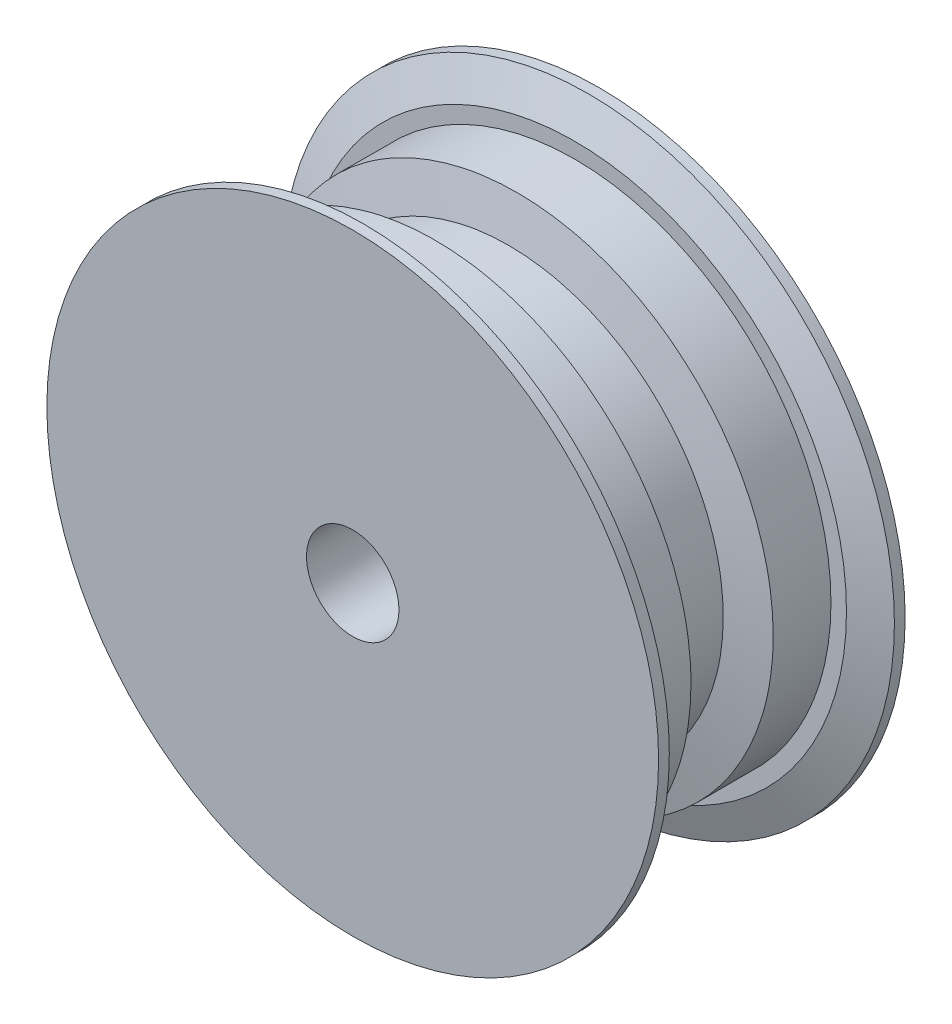
ISO-10303-21;
HEADER;
FILE_DESCRIPTION(('STEP AP214'),'2;1');
FILE_NAME('part.step','',(''),(''),'','','');
FILE_SCHEMA(('AUTOMOTIVE_DESIGN { 1 0 10303 214 1 1 1 1 }'));
ENDSEC;
DATA;
#1=APPLICATION_CONTEXT('core data for automotive mechanical design processes');
#2=APPLICATION_PROTOCOL_DEFINITION('international standard','automotive_design',2000,#1);
#3=PRODUCT_CONTEXT('',#1,'mechanical');
#4=PRODUCT('Part','Part','',(#3));
#5=PRODUCT_RELATED_PRODUCT_CATEGORY('part','',(#4));
#6=PRODUCT_DEFINITION_FORMATION('','',#4);
#7=PRODUCT_DEFINITION_CONTEXT('part definition',#1,'design');
#8=PRODUCT_DEFINITION('design','',#6,#7);
#9=PRODUCT_DEFINITION_SHAPE('','',#8);
#10=(LENGTH_UNIT() NAMED_UNIT(*) SI_UNIT(.MILLI.,.METRE.));
#11=(NAMED_UNIT(*) PLANE_ANGLE_UNIT() SI_UNIT($,.RADIAN.));
#12=(NAMED_UNIT(*) SI_UNIT($,.STERADIAN.) SOLID_ANGLE_UNIT());
#13=UNCERTAINTY_MEASURE_WITH_UNIT(LENGTH_MEASURE(1.E-05),#10,'distance_accuracy_value','');
#14=(GEOMETRIC_REPRESENTATION_CONTEXT(3) GLOBAL_UNCERTAINTY_ASSIGNED_CONTEXT((#13)) GLOBAL_UNIT_ASSIGNED_CONTEXT((#10,
#11,#12)) REPRESENTATION_CONTEXT('',''));
#15=CARTESIAN_POINT('',(0.,0.,0.));
#16=DIRECTION('',(0.,0.,1.));
#17=DIRECTION('',(1.,0.,0.));
#18=AXIS2_PLACEMENT_3D('',#15,#16,#17);
#19=CARTESIAN_POINT('',(-15.92453,0.,-2.415330196));
#20=CARTESIAN_POINT('',(-15.92453,-2.08451610153185,-2.415330196));
#21=CARTESIAN_POINT('',(-15.5100571084165,-4.1682120378053,-2.415330196));
#22=CARTESIAN_POINT('',(-13.9146375553075,-8.01989556059634,-2.415330196));
#23=CARTESIAN_POINT('',(-12.7343186210947,-9.78636767932256,-2.415330196));
#24=CARTESIAN_POINT('',(-9.78636767932254,-12.7343186210947,-2.415330196));
#25=CARTESIAN_POINT('',(-8.01989556059562,-13.9146375553078,-2.415330196));
#26=CARTESIAN_POINT('',(-4.16821203780611,-15.5100571084162,-2.415330196));
#27=CARTESIAN_POINT('',(-2.08451610153184,-15.92453,-2.415330196));
#28=CARTESIAN_POINT('',(2.08451610153186,-15.92453,-2.415330196));
#29=CARTESIAN_POINT('',(4.16821203782218,-15.5100571084095,-2.415330196));
#30=CARTESIAN_POINT('',(8.01989556057951,-13.9146375553144,-2.415330196));
#31=CARTESIAN_POINT('',(9.78636767932256,-12.7343186210947,-2.415330196));
#32=CARTESIAN_POINT('',(12.7343186210947,-9.78636767932254,-2.415330196));
#33=CARTESIAN_POINT('',(13.9146375553072,-8.01989556059687,-2.415330196));
#34=CARTESIAN_POINT('',(15.5100571084167,-4.16821203780481,-2.415330196));
#35=CARTESIAN_POINT('',(15.92453,-2.08451610152868,-2.415330196));
#36=CARTESIAN_POINT('',(15.92453,2.08451610152868,-2.415330196));
#37=CARTESIAN_POINT('',(15.5100571084166,4.16821203780513,-2.415330196));
#38=CARTESIAN_POINT('',(13.9146375553074,8.01989556059655,-2.415330196));
#39=CARTESIAN_POINT('',(12.7343186210947,9.78636767932255,-2.415330196));
#40=CARTESIAN_POINT('',(9.78636767932255,12.7343186210947,-2.415330196));
#41=CARTESIAN_POINT('',(8.0198955605982,13.9146375553067,-2.415330196));
#42=CARTESIAN_POINT('',(4.16821203780347,15.5100571084172,-2.415330196));
#43=CARTESIAN_POINT('',(2.08451610153185,15.92453,-2.415330196));
#44=CARTESIAN_POINT('',(-2.08451610153185,15.92453,-2.415330196));
#45=CARTESIAN_POINT('',(-4.16821203780593,15.5100571084162,-2.415330196));
#46=CARTESIAN_POINT('',(-8.01989556059577,13.9146375553077,-2.415330196));
#47=CARTESIAN_POINT('',(-9.78636767932256,12.7343186210947,-2.415330196));
#48=CARTESIAN_POINT('',(-12.7343186210947,9.78636767932254,-2.415330196));
#49=CARTESIAN_POINT('',(-13.9146375553071,8.0198955605973,-2.415330196));
#50=CARTESIAN_POINT('',(-15.5100571084169,4.16821203780442,-2.415330196));
#51=CARTESIAN_POINT('',(-15.92453,2.08451610153185,-2.415330196));
#52=CARTESIAN_POINT('',(-15.92453,0.,-2.415330196));
#53=CARTESIAN_POINT('',(-18.996410064,0.,-3.050330196));
#54=CARTESIAN_POINT('',(-18.996410064,-2.48662426141994,-3.050330196));
#55=CARTESIAN_POINT('',(-18.5019843566856,-4.97227014573484,-3.050330196));
#56=CARTESIAN_POINT('',(-16.5988045419565,-9.56695266607761,-3.050330196));
#57=CARTESIAN_POINT('',(-15.190799251967,-11.6741814969426,-3.050330196));
#58=CARTESIAN_POINT('',(-11.6741814969426,-15.190799251967,-3.050330196));
#59=CARTESIAN_POINT('',(-9.56695266607767,-16.5988045419564,-3.050330196));
#60=CARTESIAN_POINT('',(-4.97227014573489,-18.5019843566856,-3.050330196));
#61=CARTESIAN_POINT('',(-2.48662426141993,-18.996410064,-3.050330196));
#62=CARTESIAN_POINT('',(2.48662426141995,-18.996410064,-3.050330196));
#63=CARTESIAN_POINT('',(4.97227014575428,-18.501984356677,-3.050330196));
#64=CARTESIAN_POINT('',(9.56695266605823,-16.5988045419651,-3.050330196));
#65=CARTESIAN_POINT('',(11.6741814969426,-15.190799251967,-3.050330196));
#66=CARTESIAN_POINT('',(15.190799251967,-11.6741814969426,-3.050330196));
#67=CARTESIAN_POINT('',(16.5988045419598,-9.56695266608006,-3.050330196));
#68=CARTESIAN_POINT('',(18.5019843566823,-4.97227014573244,-3.050330196));
#69=CARTESIAN_POINT('',(18.996410064,-2.48662426141617,-3.050330196));
#70=CARTESIAN_POINT('',(18.996410064,2.48662426141617,-3.050330196));
#71=CARTESIAN_POINT('',(18.5019843566866,4.97227014573568,-3.050330196));
#72=CARTESIAN_POINT('',(16.5988045419554,9.56695266607683,-3.050330196));
#73=CARTESIAN_POINT('',(15.1907992519691,11.6741814969426,-3.050330196));
#74=CARTESIAN_POINT('',(11.6741814969404,15.190799251967,-3.050330196));
#75=CARTESIAN_POINT('',(9.56695266607871,16.5988045419564,-3.050330196));
#76=CARTESIAN_POINT('',(4.97227014573378,18.5019843566856,-3.050330196));
#77=CARTESIAN_POINT('',(2.48662426141994,18.996410064,-3.050330196));
#78=CARTESIAN_POINT('',(-2.48662426141994,18.996410064,-3.050330196));
#79=CARTESIAN_POINT('',(-4.9722701457338,18.5019843566813,-3.050330196));
#80=CARTESIAN_POINT('',(-9.56695266607872,16.5988045419607,-3.050330196));
#81=CARTESIAN_POINT('',(-11.6741814969426,15.190799251967,-3.050330196));
#82=CARTESIAN_POINT('',(-15.190799251967,11.6741814969426,-3.050330196));
#83=CARTESIAN_POINT('',(-16.5988045419564,9.56695266607766,-3.050330196));
#84=CARTESIAN_POINT('',(-18.5019843566856,4.97227014573489,-3.050330196));
#85=CARTESIAN_POINT('',(-18.996410064,2.48662426141994,-3.050330196));
#86=CARTESIAN_POINT('',(-18.996410064,0.,-3.050330196));
#87=B_SPLINE_SURFACE_WITH_KNOTS('',1,3,((#19,#20,#21,#22,#23,#24,#25,#26,#27,#28,#29,#30,#31,
#32,#33,#34,#35,#36,#37,#38,#39,#40,#41,#42,#43,#44,#45,#46,#47,#48,#49,#50,#51,#52),(#53,#54,
#55,#56,#57,#58,#59,#60,#61,#62,#63,#64,#65,#66,#67,#68,#69,#70,#71,#72,#73,#74,#75,#76,#77,#78,
#79,#80,#81,#82,#83,#84,#85,#86)),.UNSPECIFIED.,.F.,.T.,.F.,(2,2),(4,2,2,2,2,2,2,2,2,2,2,2,2,2,
2,2,4),(0.,1.),(-3.14159265358979,-2.74889357189107,-2.35619449019234,-1.96349540849362,
-1.5707963267949,-1.17809724509617,-0.785398163397448,-0.392699081698724,0.,0.392699081698724,
0.785398163397448,1.17809724509617,1.5707963267949,1.96349540849362,2.35619449019234,
2.74889357189107,3.14159265358979),.UNSPECIFIED.);
#88=CARTESIAN_POINT('',(-18.996410064,0.,-3.050330196));
#89=CARTESIAN_POINT('',(-18.996410064,-2.48662426141994,-3.050330196));
#90=CARTESIAN_POINT('',(-18.5019843566856,-4.97227014573484,-3.050330196));
#91=CARTESIAN_POINT('',(-16.5988045419565,-9.56695266607761,-3.050330196));
#92=CARTESIAN_POINT('',(-15.190799251967,-11.6741814969426,-3.050330196));
#93=CARTESIAN_POINT('',(-11.6741814969426,-15.190799251967,-3.050330196));
#94=CARTESIAN_POINT('',(-9.56695266607767,-16.5988045419564,-3.050330196));
#95=CARTESIAN_POINT('',(-4.97227014573489,-18.5019843566856,-3.050330196));
#96=CARTESIAN_POINT('',(-2.48662426141993,-18.996410064,-3.050330196));
#97=CARTESIAN_POINT('',(2.48662426141995,-18.996410064,-3.050330196));
#98=CARTESIAN_POINT('',(4.97227014575428,-18.501984356677,-3.050330196));
#99=CARTESIAN_POINT('',(9.56695266605823,-16.5988045419651,-3.050330196));
#100=CARTESIAN_POINT('',(11.6741814969426,-15.190799251967,-3.050330196));
#101=CARTESIAN_POINT('',(15.190799251967,-11.6741814969426,-3.050330196));
#102=CARTESIAN_POINT('',(16.5988045419598,-9.56695266608006,-3.050330196));
#103=CARTESIAN_POINT('',(18.5019843566823,-4.97227014573244,-3.050330196));
#104=CARTESIAN_POINT('',(18.996410064,-2.48662426141617,-3.050330196));
#105=CARTESIAN_POINT('',(18.996410064,2.48662426141617,-3.050330196));
#106=CARTESIAN_POINT('',(18.5019843566866,4.97227014573568,-3.050330196));
#107=CARTESIAN_POINT('',(16.5988045419554,9.56695266607683,-3.050330196));
#108=CARTESIAN_POINT('',(15.1907992519691,11.6741814969426,-3.050330196));
#109=CARTESIAN_POINT('',(11.6741814969404,15.190799251967,-3.050330196));
#110=CARTESIAN_POINT('',(9.56695266607871,16.5988045419564,-3.050330196));
#111=CARTESIAN_POINT('',(4.97227014573378,18.5019843566856,-3.050330196));
#112=CARTESIAN_POINT('',(2.48662426141994,18.996410064,-3.050330196));
#113=CARTESIAN_POINT('',(-2.48662426141994,18.996410064,-3.050330196));
#114=CARTESIAN_POINT('',(-4.9722701457338,18.5019843566813,-3.050330196));
#115=CARTESIAN_POINT('',(-9.56695266607872,16.5988045419607,-3.050330196));
#116=CARTESIAN_POINT('',(-11.6741814969426,15.190799251967,-3.050330196));
#117=CARTESIAN_POINT('',(-15.190799251967,11.6741814969426,-3.050330196));
#118=CARTESIAN_POINT('',(-16.5988045419564,9.56695266607766,-3.050330196));
#119=CARTESIAN_POINT('',(-18.5019843566856,4.97227014573489,-3.050330196));
#120=CARTESIAN_POINT('',(-18.996410064,2.48662426141994,-3.050330196));
#121=CARTESIAN_POINT('',(-18.996410064,0.,-3.050330196));
#122=B_SPLINE_CURVE_WITH_KNOTS('',3,(#88,#89,#90,#91,#92,#93,#94,#95,#96,#97,#98,#99,#100,#101,
#102,#103,#104,#105,#106,#107,#108,#109,#110,#111,#112,#113,#114,#115,#116,#117,#118,#119,#120,
#121),.UNSPECIFIED.,.T.,.F.,(4,2,2,2,2,2,2,2,2,2,2,2,2,2,2,2,4),(-3.14159265358979,
-2.74889357189107,-2.35619449019234,-1.96349540849362,-1.5707963267949,-1.17809724509617,
-0.785398163397448,-0.392699081698724,0.,0.392699081698724,0.785398163397448,1.17809724509617,
1.5707963267949,1.96349540849362,2.35619449019234,2.74889357189107,3.14159265358979),.UNSPECIFIED.);
#123=CARTESIAN_POINT('',(-18.996410064,0.,-3.050330196));
#124=VERTEX_POINT('',#123);
#125=EDGE_CURVE('E216',#124,#124,#122,.F.);
#126=CARTESIAN_POINT('',(-15.92453,0.,-2.415330196));
#127=CARTESIAN_POINT('',(-15.92453,2.08451610153185,-2.415330196));
#128=CARTESIAN_POINT('',(-15.5100571084169,4.16821203780442,-2.415330196));
#129=CARTESIAN_POINT('',(-13.9146375553071,8.0198955605973,-2.415330196));
#130=CARTESIAN_POINT('',(-12.7343186210947,9.78636767932254,-2.415330196));
#131=CARTESIAN_POINT('',(-9.78636767932256,12.7343186210947,-2.415330196));
#132=CARTESIAN_POINT('',(-8.01989556059577,13.9146375553077,-2.415330196));
#133=CARTESIAN_POINT('',(-4.16821203780593,15.5100571084162,-2.415330196));
#134=CARTESIAN_POINT('',(-2.08451610153185,15.92453,-2.415330196));
#135=CARTESIAN_POINT('',(2.08451610153185,15.92453,-2.415330196));
#136=CARTESIAN_POINT('',(4.16821203780347,15.5100571084172,-2.415330196));
#137=CARTESIAN_POINT('',(8.0198955605982,13.9146375553067,-2.415330196));
#138=CARTESIAN_POINT('',(9.78636767932255,12.7343186210947,-2.415330196));
#139=CARTESIAN_POINT('',(12.7343186210947,9.78636767932255,-2.415330196));
#140=CARTESIAN_POINT('',(13.9146375553074,8.01989556059655,-2.415330196));
#141=CARTESIAN_POINT('',(15.5100571084166,4.16821203780513,-2.415330196));
#142=CARTESIAN_POINT('',(15.92453,2.08451610152868,-2.415330196));
#143=CARTESIAN_POINT('',(15.92453,-2.08451610152868,-2.415330196));
#144=CARTESIAN_POINT('',(15.5100571084167,-4.16821203780481,-2.415330196));
#145=CARTESIAN_POINT('',(13.9146375553072,-8.01989556059687,-2.415330196));
#146=CARTESIAN_POINT('',(12.7343186210947,-9.78636767932254,-2.415330196));
#147=CARTESIAN_POINT('',(9.78636767932256,-12.7343186210947,-2.415330196));
#148=CARTESIAN_POINT('',(8.01989556057951,-13.9146375553144,-2.415330196));
#149=CARTESIAN_POINT('',(4.16821203782218,-15.5100571084095,-2.415330196));
#150=CARTESIAN_POINT('',(2.08451610153186,-15.92453,-2.415330196));
#151=CARTESIAN_POINT('',(-2.08451610153184,-15.92453,-2.415330196));
#152=CARTESIAN_POINT('',(-4.16821203780611,-15.5100571084162,-2.415330196));
#153=CARTESIAN_POINT('',(-8.01989556059562,-13.9146375553078,-2.415330196));
#154=CARTESIAN_POINT('',(-9.78636767932254,-12.7343186210947,-2.415330196));
#155=CARTESIAN_POINT('',(-12.7343186210947,-9.78636767932256,-2.415330196));
#156=CARTESIAN_POINT('',(-13.9146375553075,-8.01989556059634,-2.415330196));
#157=CARTESIAN_POINT('',(-15.5100571084165,-4.1682120378053,-2.415330196));
#158=CARTESIAN_POINT('',(-15.92453,-2.08451610153185,-2.415330196));
#159=CARTESIAN_POINT('',(-15.92453,0.,-2.415330196));
#160=B_SPLINE_CURVE_WITH_KNOTS('',3,(#126,#127,#128,#129,#130,#131,#132,#133,#134,#135,#136,
#137,#138,#139,#140,#141,#142,#143,#144,#145,#146,#147,#148,#149,#150,#151,#152,#153,#154,#155,
#156,#157,#158,#159),.UNSPECIFIED.,.T.,.F.,(4,2,2,2,2,2,2,2,2,2,2,2,2,2,2,2,4),
(-3.14159265358979,-2.74889357189107,-2.35619449019234,-1.96349540849362,-1.5707963267949,
-1.17809724509617,-0.785398163397448,-0.392699081698724,0.,0.392699081698724,0.785398163397448,
1.17809724509617,1.5707963267949,1.96349540849362,2.35619449019234,2.74889357189107,
3.14159265358979),.UNSPECIFIED.);
#161=CARTESIAN_POINT('',(-15.92453,0.,-2.415330196));
#162=VERTEX_POINT('',#161);
#163=EDGE_CURVE('E61',#162,#162,#160,.F.);
#164=ORIENTED_EDGE('',*,*,#125,.F.);
#165=EDGE_LOOP('',(#164));
#166=FACE_BOUND('',#165,.T.);
#167=ORIENTED_EDGE('',*,*,#163,.F.);
#168=EDGE_LOOP('',(#167));
#169=FACE_BOUND('',#168,.T.);
#170=ADVANCED_FACE('F41',(#166,#169),#87,.T.);
#171=CARTESIAN_POINT('',(-18.996410064,0.,3.050330196));
#172=CARTESIAN_POINT('',(-18.996410064,-2.48662426141994,3.050330196));
#173=CARTESIAN_POINT('',(-18.5019843566856,-4.97227014573484,3.050330196));
#174=CARTESIAN_POINT('',(-16.5988045419565,-9.56695266607761,3.050330196));
#175=CARTESIAN_POINT('',(-15.190799251967,-11.6741814969426,3.050330196));
#176=CARTESIAN_POINT('',(-11.6741814969426,-15.190799251967,3.050330196));
#177=CARTESIAN_POINT('',(-9.56695266607767,-16.5988045419564,3.050330196));
#178=CARTESIAN_POINT('',(-4.97227014573489,-18.5019843566856,3.050330196));
#179=CARTESIAN_POINT('',(-2.48662426141993,-18.996410064,3.050330196));
#180=CARTESIAN_POINT('',(2.48662426141995,-18.996410064,3.050330196));
#181=CARTESIAN_POINT('',(4.97227014575428,-18.501984356677,3.050330196));
#182=CARTESIAN_POINT('',(9.56695266605823,-16.5988045419651,3.050330196));
#183=CARTESIAN_POINT('',(11.6741814969426,-15.190799251967,3.050330196));
#184=CARTESIAN_POINT('',(15.190799251967,-11.6741814969426,3.050330196));
#185=CARTESIAN_POINT('',(16.5988045419598,-9.56695266608006,3.050330196));
#186=CARTESIAN_POINT('',(18.5019843566823,-4.97227014573244,3.050330196));
#187=CARTESIAN_POINT('',(18.996410064,-2.48662426141617,3.050330196));
#188=CARTESIAN_POINT('',(18.996410064,2.48662426141617,3.050330196));
#189=CARTESIAN_POINT('',(18.5019843566866,4.97227014573568,3.050330196));
#190=CARTESIAN_POINT('',(16.5988045419554,9.56695266607683,3.050330196));
#191=CARTESIAN_POINT('',(15.1907992519691,11.6741814969426,3.050330196));
#192=CARTESIAN_POINT('',(11.6741814969404,15.190799251967,3.050330196));
#193=CARTESIAN_POINT('',(9.56695266607871,16.5988045419564,3.050330196));
#194=CARTESIAN_POINT('',(4.97227014573378,18.5019843566856,3.050330196));
#195=CARTESIAN_POINT('',(2.48662426141994,18.996410064,3.050330196));
#196=CARTESIAN_POINT('',(-2.48662426141994,18.996410064,3.050330196));
#197=CARTESIAN_POINT('',(-4.9722701457338,18.5019843566813,3.050330196));
#198=CARTESIAN_POINT('',(-9.56695266607872,16.5988045419607,3.050330196));
#199=CARTESIAN_POINT('',(-11.6741814969426,15.190799251967,3.050330196));
#200=CARTESIAN_POINT('',(-15.190799251967,11.6741814969426,3.050330196));
#201=CARTESIAN_POINT('',(-16.5988045419564,9.56695266607766,3.050330196));
#202=CARTESIAN_POINT('',(-18.5019843566856,4.97227014573489,3.050330196));
#203=CARTESIAN_POINT('',(-18.996410064,2.48662426141994,3.050330196));
#204=CARTESIAN_POINT('',(-18.996410064,0.,3.050330196));
#205=CARTESIAN_POINT('',(-15.92453,0.,2.415330196));
#206=CARTESIAN_POINT('',(-15.92453,-2.08451610153185,2.415330196));
#207=CARTESIAN_POINT('',(-15.5100571084165,-4.1682120378053,2.415330196));
#208=CARTESIAN_POINT('',(-13.9146375553075,-8.01989556059634,2.415330196));
#209=CARTESIAN_POINT('',(-12.7343186210947,-9.78636767932256,2.415330196));
#210=CARTESIAN_POINT('',(-9.78636767932254,-12.7343186210947,2.415330196));
#211=CARTESIAN_POINT('',(-8.01989556059562,-13.9146375553078,2.415330196));
#212=CARTESIAN_POINT('',(-4.16821203780611,-15.5100571084162,2.415330196));
#213=CARTESIAN_POINT('',(-2.08451610153184,-15.92453,2.415330196));
#214=CARTESIAN_POINT('',(2.08451610153186,-15.92453,2.415330196));
#215=CARTESIAN_POINT('',(4.16821203782218,-15.5100571084095,2.415330196));
#216=CARTESIAN_POINT('',(8.01989556057951,-13.9146375553144,2.415330196));
#217=CARTESIAN_POINT('',(9.78636767932256,-12.7343186210947,2.415330196));
#218=CARTESIAN_POINT('',(12.7343186210947,-9.78636767932254,2.415330196));
#219=CARTESIAN_POINT('',(13.9146375553072,-8.01989556059687,2.415330196));
#220=CARTESIAN_POINT('',(15.5100571084167,-4.16821203780481,2.415330196));
#221=CARTESIAN_POINT('',(15.92453,-2.08451610152868,2.415330196));
#222=CARTESIAN_POINT('',(15.92453,2.08451610152868,2.415330196));
#223=CARTESIAN_POINT('',(15.5100571084166,4.16821203780513,2.415330196));
#224=CARTESIAN_POINT('',(13.9146375553074,8.01989556059655,2.415330196));
#225=CARTESIAN_POINT('',(12.7343186210947,9.78636767932255,2.415330196));
#226=CARTESIAN_POINT('',(9.78636767932255,12.7343186210947,2.415330196));
#227=CARTESIAN_POINT('',(8.0198955605982,13.9146375553067,2.415330196));
#228=CARTESIAN_POINT('',(4.16821203780347,15.5100571084172,2.415330196));
#229=CARTESIAN_POINT('',(2.08451610153185,15.92453,2.415330196));
#230=CARTESIAN_POINT('',(-2.08451610153185,15.92453,2.415330196));
#231=CARTESIAN_POINT('',(-4.16821203780593,15.5100571084162,2.415330196));
#232=CARTESIAN_POINT('',(-8.01989556059577,13.9146375553077,2.415330196));
#233=CARTESIAN_POINT('',(-9.78636767932256,12.7343186210947,2.415330196));
#234=CARTESIAN_POINT('',(-12.7343186210947,9.78636767932254,2.415330196));
#235=CARTESIAN_POINT('',(-13.9146375553071,8.0198955605973,2.415330196));
#236=CARTESIAN_POINT('',(-15.5100571084169,4.16821203780442,2.415330196));
#237=CARTESIAN_POINT('',(-15.92453,2.08451610153185,2.415330196));
#238=CARTESIAN_POINT('',(-15.92453,0.,2.415330196));
#239=B_SPLINE_SURFACE_WITH_KNOTS('',1,3,((#171,#172,#173,#174,#175,#176,#177,#178,#179,#180,
#181,#182,#183,#184,#185,#186,#187,#188,#189,#190,#191,#192,#193,#194,#195,#196,#197,#198,#199,
#200,#201,#202,#203,#204),(#205,#206,#207,#208,#209,#210,#211,#212,#213,#214,#215,#216,#217,
#218,#219,#220,#221,#222,#223,#224,#225,#226,#227,#228,#229,#230,#231,#232,#233,#234,#235,#236,
#237,#238)),.UNSPECIFIED.,.F.,.T.,.F.,(2,2),(4,2,2,2,2,2,2,2,2,2,2,2,2,2,2,2,4),(0.,1.),
(-3.14159265358979,-2.74889357189107,-2.35619449019234,-1.96349540849362,-1.5707963267949,
-1.17809724509617,-0.785398163397448,-0.392699081698724,0.,0.392699081698724,0.785398163397448,
1.17809724509617,1.5707963267949,1.96349540849362,2.35619449019234,2.74889357189107,
3.14159265358979),.UNSPECIFIED.);
#240=CARTESIAN_POINT('',(-18.996410064,0.,3.050330196));
#241=CARTESIAN_POINT('',(-18.996410064,2.48662426141994,3.050330196));
#242=CARTESIAN_POINT('',(-18.5019843566856,4.97227014573489,3.050330196));
#243=CARTESIAN_POINT('',(-16.5988045419564,9.56695266607766,3.050330196));
#244=CARTESIAN_POINT('',(-15.190799251967,11.6741814969426,3.050330196));
#245=CARTESIAN_POINT('',(-11.6741814969426,15.190799251967,3.050330196));
#246=CARTESIAN_POINT('',(-9.56695266607872,16.5988045419607,3.050330196));
#247=CARTESIAN_POINT('',(-4.9722701457338,18.5019843566813,3.050330196));
#248=CARTESIAN_POINT('',(-2.48662426141994,18.996410064,3.050330196));
#249=CARTESIAN_POINT('',(2.48662426141994,18.996410064,3.050330196));
#250=CARTESIAN_POINT('',(4.97227014573378,18.5019843566856,3.050330196));
#251=CARTESIAN_POINT('',(9.56695266607871,16.5988045419564,3.050330196));
#252=CARTESIAN_POINT('',(11.6741814969404,15.190799251967,3.050330196));
#253=CARTESIAN_POINT('',(15.1907992519691,11.6741814969426,3.050330196));
#254=CARTESIAN_POINT('',(16.5988045419554,9.56695266607683,3.050330196));
#255=CARTESIAN_POINT('',(18.5019843566866,4.97227014573568,3.050330196));
#256=CARTESIAN_POINT('',(18.996410064,2.48662426141617,3.050330196));
#257=CARTESIAN_POINT('',(18.996410064,-2.48662426141617,3.050330196));
#258=CARTESIAN_POINT('',(18.5019843566823,-4.97227014573244,3.050330196));
#259=CARTESIAN_POINT('',(16.5988045419598,-9.56695266608006,3.050330196));
#260=CARTESIAN_POINT('',(15.190799251967,-11.6741814969426,3.050330196));
#261=CARTESIAN_POINT('',(11.6741814969426,-15.190799251967,3.050330196));
#262=CARTESIAN_POINT('',(9.56695266605823,-16.5988045419651,3.050330196));
#263=CARTESIAN_POINT('',(4.97227014575428,-18.501984356677,3.050330196));
#264=CARTESIAN_POINT('',(2.48662426141995,-18.996410064,3.050330196));
#265=CARTESIAN_POINT('',(-2.48662426141993,-18.996410064,3.050330196));
#266=CARTESIAN_POINT('',(-4.97227014573489,-18.5019843566856,3.050330196));
#267=CARTESIAN_POINT('',(-9.56695266607767,-16.5988045419564,3.050330196));
#268=CARTESIAN_POINT('',(-11.6741814969426,-15.190799251967,3.050330196));
#269=CARTESIAN_POINT('',(-15.190799251967,-11.6741814969426,3.050330196));
#270=CARTESIAN_POINT('',(-16.5988045419565,-9.56695266607761,3.050330196));
#271=CARTESIAN_POINT('',(-18.5019843566856,-4.97227014573484,3.050330196));
#272=CARTESIAN_POINT('',(-18.996410064,-2.48662426141994,3.050330196));
#273=CARTESIAN_POINT('',(-18.996410064,0.,3.050330196));
#274=B_SPLINE_CURVE_WITH_KNOTS('',3,(#240,#241,#242,#243,#244,#245,#246,#247,#248,#249,#250,
#251,#252,#253,#254,#255,#256,#257,#258,#259,#260,#261,#262,#263,#264,#265,#266,#267,#268,#269,
#270,#271,#272,#273),.UNSPECIFIED.,.T.,.F.,(4,2,2,2,2,2,2,2,2,2,2,2,2,2,2,2,4),
(-3.14159265358979,-2.74889357189107,-2.35619449019234,-1.96349540849362,-1.5707963267949,
-1.17809724509617,-0.785398163397448,-0.392699081698724,0.,0.392699081698724,0.785398163397448,
1.17809724509617,1.5707963267949,1.96349540849362,2.35619449019234,2.74889357189107,
3.14159265358979),.UNSPECIFIED.);
#275=CARTESIAN_POINT('',(-18.996410064,0.,3.050330196));
#276=VERTEX_POINT('',#275);
#277=EDGE_CURVE('E291',#276,#276,#274,.T.);
#278=CARTESIAN_POINT('',(-15.92453,0.,2.415330196));
#279=CARTESIAN_POINT('',(-15.92453,-2.08451610153185,2.415330196));
#280=CARTESIAN_POINT('',(-15.5100571084165,-4.1682120378053,2.415330196));
#281=CARTESIAN_POINT('',(-13.9146375553075,-8.01989556059634,2.415330196));
#282=CARTESIAN_POINT('',(-12.7343186210947,-9.78636767932256,2.415330196));
#283=CARTESIAN_POINT('',(-9.78636767932254,-12.7343186210947,2.415330196));
#284=CARTESIAN_POINT('',(-8.01989556059562,-13.9146375553078,2.415330196));
#285=CARTESIAN_POINT('',(-4.16821203780611,-15.5100571084162,2.415330196));
#286=CARTESIAN_POINT('',(-2.08451610153184,-15.92453,2.415330196));
#287=CARTESIAN_POINT('',(2.08451610153186,-15.92453,2.415330196));
#288=CARTESIAN_POINT('',(4.16821203782218,-15.5100571084095,2.415330196));
#289=CARTESIAN_POINT('',(8.01989556057951,-13.9146375553144,2.415330196));
#290=CARTESIAN_POINT('',(9.78636767932256,-12.7343186210947,2.415330196));
#291=CARTESIAN_POINT('',(12.7343186210947,-9.78636767932254,2.415330196));
#292=CARTESIAN_POINT('',(13.9146375553072,-8.01989556059687,2.415330196));
#293=CARTESIAN_POINT('',(15.5100571084167,-4.16821203780481,2.415330196));
#294=CARTESIAN_POINT('',(15.92453,-2.08451610152868,2.415330196));
#295=CARTESIAN_POINT('',(15.92453,2.08451610152868,2.415330196));
#296=CARTESIAN_POINT('',(15.5100571084166,4.16821203780513,2.415330196));
#297=CARTESIAN_POINT('',(13.9146375553074,8.01989556059655,2.415330196));
#298=CARTESIAN_POINT('',(12.7343186210947,9.78636767932255,2.415330196));
#299=CARTESIAN_POINT('',(9.78636767932255,12.7343186210947,2.415330196));
#300=CARTESIAN_POINT('',(8.0198955605982,13.9146375553067,2.415330196));
#301=CARTESIAN_POINT('',(4.16821203780347,15.5100571084172,2.415330196));
#302=CARTESIAN_POINT('',(2.08451610153185,15.92453,2.415330196));
#303=CARTESIAN_POINT('',(-2.08451610153185,15.92453,2.415330196));
#304=CARTESIAN_POINT('',(-4.16821203780593,15.5100571084162,2.415330196));
#305=CARTESIAN_POINT('',(-8.01989556059577,13.9146375553077,2.415330196));
#306=CARTESIAN_POINT('',(-9.78636767932256,12.7343186210947,2.415330196));
#307=CARTESIAN_POINT('',(-12.7343186210947,9.78636767932254,2.415330196));
#308=CARTESIAN_POINT('',(-13.9146375553071,8.0198955605973,2.415330196));
#309=CARTESIAN_POINT('',(-15.5100571084169,4.16821203780442,2.415330196));
#310=CARTESIAN_POINT('',(-15.92453,2.08451610153185,2.415330196));
#311=CARTESIAN_POINT('',(-15.92453,0.,2.415330196));
#312=B_SPLINE_CURVE_WITH_KNOTS('',3,(#278,#279,#280,#281,#282,#283,#284,#285,#286,#287,#288,
#289,#290,#291,#292,#293,#294,#295,#296,#297,#298,#299,#300,#301,#302,#303,#304,#305,#306,#307,
#308,#309,#310,#311),.UNSPECIFIED.,.T.,.F.,(4,2,2,2,2,2,2,2,2,2,2,2,2,2,2,2,4),
(-3.14159265358979,-2.74889357189107,-2.35619449019234,-1.96349540849362,-1.5707963267949,
-1.17809724509617,-0.785398163397448,-0.392699081698724,0.,0.392699081698724,0.785398163397448,
1.17809724509617,1.5707963267949,1.96349540849362,2.35619449019234,2.74889357189107,
3.14159265358979),.UNSPECIFIED.);
#313=CARTESIAN_POINT('',(-15.92453,0.,2.415330196));
#314=VERTEX_POINT('',#313);
#315=EDGE_CURVE('E253',#314,#314,#312,.F.);
#316=ORIENTED_EDGE('',*,*,#277,.T.);
#317=EDGE_LOOP('',(#316));
#318=FACE_BOUND('',#317,.T.);
#319=ORIENTED_EDGE('',*,*,#315,.F.);
#320=EDGE_LOOP('',(#319));
#321=FACE_BOUND('',#320,.T.);
#322=ADVANCED_FACE('F77',(#318,#321),#239,.T.);
#323=CARTESIAN_POINT('',(0.,0.,-73.3169102411602));
#324=DIRECTION('',(0.,0.,1.));
#325=DIRECTION('',(1.,0.,0.));
#326=AXIS2_PLACEMENT_3D('',#323,#324,#325);
#327=CYLINDRICAL_SURFACE('',#326,18.99793);
#328=ORIENTED_EDGE('',*,*,#277,.F.);
#329=EDGE_LOOP('',(#328));
#330=FACE_BOUND('',#329,.T.);
#331=CARTESIAN_POINT('',(0.,0.,7.332999939));
#332=DIRECTION('',(0.,0.,1.));
#333=DIRECTION('',(1.,0.,0.));
#334=AXIS2_PLACEMENT_3D('',#331,#332,#333);
#335=CIRCLE('',#334,18.99793);
#336=CARTESIAN_POINT('',(18.99793,0.,7.332999939));
#337=VERTEX_POINT('',#336);
#338=EDGE_CURVE('E302',#337,#337,#335,.T.);
#339=ORIENTED_EDGE('',*,*,#338,.F.);
#340=EDGE_LOOP('',(#339));
#341=FACE_BOUND('',#340,.T.);
#342=ADVANCED_FACE('F220',(#330,#341),#327,.T.);
#343=CARTESIAN_POINT('',(0.,0.,-7.332999939));
#344=DIRECTION('',(0.,0.,1.));
#345=DIRECTION('',(1.,0.,0.));
#346=AXIS2_PLACEMENT_3D('',#343,#344,#345);
#347=CIRCLE('',#346,18.99793);
#348=CARTESIAN_POINT('',(18.99793,0.,-7.332999939));
#349=VERTEX_POINT('',#348);
#350=EDGE_CURVE('E300',#349,#349,#347,.F.);
#351=ORIENTED_EDGE('',*,*,#350,.F.);
#352=EDGE_LOOP('',(#351));
#353=FACE_BOUND('',#352,.T.);
#354=ORIENTED_EDGE('',*,*,#125,.T.);
#355=EDGE_LOOP('',(#354));
#356=FACE_BOUND('',#355,.T.);
#357=ADVANCED_FACE('F230',(#353,#356),#327,.T.);
#358=CARTESIAN_POINT('',(0.,0.,9.144));
#359=DIRECTION('',(0.,0.,1.));
#360=DIRECTION('',(1.,0.,0.));
#361=AXIS2_PLACEMENT_3D('',#358,#359,#360);
#362=PLANE('',#361);
#363=CARTESIAN_POINT('',(0.,0.,9.144));
#364=DIRECTION('',(0.,0.,1.));
#365=DIRECTION('',(1.,0.,0.));
#366=AXIS2_PLACEMENT_3D('',#363,#364,#365);
#367=CIRCLE('',#366,3.429);
#368=CARTESIAN_POINT('',(3.429,0.,9.144));
#369=VERTEX_POINT('',#368);
#370=EDGE_CURVE('E312',#369,#369,#367,.T.);
#371=ORIENTED_EDGE('',*,*,#370,.F.);
#372=EDGE_LOOP('',(#371));
#373=FACE_BOUND('',#372,.T.);
#374=CARTESIAN_POINT('',(0.,0.,9.144));
#375=DIRECTION('',(0.,0.,1.));
#376=DIRECTION('',(1.,0.,0.));
#377=AXIS2_PLACEMENT_3D('',#374,#375,#376);
#378=CIRCLE('',#377,22.68855);
#379=CARTESIAN_POINT('',(22.68855,0.,9.144));
#380=VERTEX_POINT('',#379);
#381=EDGE_CURVE('E299',#380,#380,#378,.T.);
#382=ORIENTED_EDGE('',*,*,#381,.T.);
#383=EDGE_LOOP('',(#382));
#384=FACE_BOUND('',#383,.T.);
#385=ADVANCED_FACE('F337',(#373,#384),#362,.T.);
#386=CARTESIAN_POINT('',(0.,0.,9.144));
#387=DIRECTION('',(0.,0.,-1.));
#388=DIRECTION('',(-1.,0.,0.));
#389=AXIS2_PLACEMENT_3D('',#386,#387,#388);
#390=CYLINDRICAL_SURFACE('',#389,22.68855);
#391=CARTESIAN_POINT('',(0.,0.,-8.348999939));
#392=DIRECTION('',(0.,0.,1.));
#393=DIRECTION('',(1.,0.,0.));
#394=AXIS2_PLACEMENT_3D('',#391,#392,#393);
#395=CIRCLE('',#394,22.68855);
#396=CARTESIAN_POINT('',(22.68855,0.,-8.348999939));
#397=VERTEX_POINT('',#396);
#398=EDGE_CURVE('E56',#397,#397,#395,.F.);
#399=ORIENTED_EDGE('',*,*,#398,.T.);
#400=EDGE_LOOP('',(#399));
#401=FACE_BOUND('',#400,.T.);
#402=CARTESIAN_POINT('',(0.,0.,-9.144));
#403=DIRECTION('',(0.,0.,1.));
#404=DIRECTION('',(1.,0.,0.));
#405=AXIS2_PLACEMENT_3D('',#402,#403,#404);
#406=CIRCLE('',#405,22.68855);
#407=CARTESIAN_POINT('',(22.68855,0.,-9.144));
#408=VERTEX_POINT('',#407);
#409=EDGE_CURVE('E315',#408,#408,#406,.T.);
#410=ORIENTED_EDGE('',*,*,#409,.T.);
#411=EDGE_LOOP('',(#410));
#412=FACE_BOUND('',#411,.T.);
#413=ADVANCED_FACE('F321',(#401,#412),#390,.T.);
#414=CARTESIAN_POINT('',(0.,0.,-9.144));
#415=DIRECTION('',(0.,0.,1.));
#416=DIRECTION('',(1.,0.,0.));
#417=AXIS2_PLACEMENT_3D('',#414,#415,#416);
#418=PLANE('',#417);
#419=ORIENTED_EDGE('',*,*,#409,.F.);
#420=EDGE_LOOP('',(#419));
#421=FACE_BOUND('',#420,.T.);
#422=CARTESIAN_POINT('',(0.,0.,-9.144));
#423=DIRECTION('',(0.,0.,1.));
#424=DIRECTION('',(1.,0.,0.));
#425=AXIS2_PLACEMENT_3D('',#422,#423,#424);
#426=CIRCLE('',#425,3.429);
#427=CARTESIAN_POINT('',(3.429,0.,-9.144));
#428=VERTEX_POINT('',#427);
#429=EDGE_CURVE('E311',#428,#428,#426,.T.);
#430=ORIENTED_EDGE('',*,*,#429,.T.);
#431=EDGE_LOOP('',(#430));
#432=FACE_BOUND('',#431,.T.);
#433=ADVANCED_FACE('F323',(#421,#432),#418,.F.);
#434=CARTESIAN_POINT('',(0.,0.,9.144));
#435=DIRECTION('',(0.,0.,-1.));
#436=DIRECTION('',(-1.,0.,0.));
#437=AXIS2_PLACEMENT_3D('',#434,#435,#436);
#438=CYLINDRICAL_SURFACE('',#437,3.429);
#439=ORIENTED_EDGE('',*,*,#370,.T.);
#440=EDGE_LOOP('',(#439));
#441=FACE_BOUND('',#440,.T.);
#442=ORIENTED_EDGE('',*,*,#429,.F.);
#443=EDGE_LOOP('',(#442));
#444=FACE_BOUND('',#443,.T.);
#445=ADVANCED_FACE('F234',(#441,#444),#438,.F.);
#446=CARTESIAN_POINT('',(0.,0.,-7.332999939));
#447=DIRECTION('',(0.,0.,1.));
#448=DIRECTION('',(1.,0.,0.));
#449=AXIS2_PLACEMENT_3D('',#446,#447,#448);
#450=PLANE('',#449);
#451=CARTESIAN_POINT('',(0.,0.,-7.332999939));
#452=DIRECTION('',(0.,0.,1.));
#453=DIRECTION('',(1.,0.,0.));
#454=AXIS2_PLACEMENT_3D('',#451,#452,#453);
#455=CIRCLE('',#454,20.14855);
#456=CARTESIAN_POINT('',(20.14855,0.,-7.332999939));
#457=VERTEX_POINT('',#456);
#458=EDGE_CURVE('E52',#457,#457,#455,.T.);
#459=ORIENTED_EDGE('',*,*,#458,.T.);
#460=EDGE_LOOP('',(#459));
#461=FACE_BOUND('',#460,.T.);
#462=ORIENTED_EDGE('',*,*,#350,.T.);
#463=EDGE_LOOP('',(#462));
#464=FACE_BOUND('',#463,.T.);
#465=ADVANCED_FACE('F232',(#461,#464),#450,.T.);
#466=CARTESIAN_POINT('',(0.,0.,-3.050330196));
#467=DIRECTION('',(0.,0.,1.));
#468=DIRECTION('',(1.,0.,0.));
#469=AXIS2_PLACEMENT_3D('',#466,#467,#468);
#470=CYLINDRICAL_SURFACE('',#469,15.92453);
#471=ORIENTED_EDGE('',*,*,#163,.T.);
#472=EDGE_LOOP('',(#471));
#473=FACE_BOUND('',#472,.T.);
#474=ORIENTED_EDGE('',*,*,#315,.T.);
#475=EDGE_LOOP('',(#474));
#476=FACE_BOUND('',#475,.T.);
#477=ADVANCED_FACE('F266',(#473,#476),#470,.T.);
#478=CARTESIAN_POINT('',(0.,0.,7.332999939));
#479=DIRECTION('',(0.,0.,1.));
#480=DIRECTION('',(1.,0.,0.));
#481=AXIS2_PLACEMENT_3D('',#478,#479,#480);
#482=CYLINDRICAL_SURFACE('',#481,22.68855);
#483=CARTESIAN_POINT('',(0.,0.,8.348999939));
#484=DIRECTION('',(0.,0.,1.));
#485=DIRECTION('',(1.,0.,0.));
#486=AXIS2_PLACEMENT_3D('',#483,#484,#485);
#487=CIRCLE('',#486,22.68855);
#488=CARTESIAN_POINT('',(22.68855,0.,8.348999939));
#489=VERTEX_POINT('',#488);
#490=EDGE_CURVE('E48',#489,#489,#487,.T.);
#491=ORIENTED_EDGE('',*,*,#490,.T.);
#492=EDGE_LOOP('',(#491));
#493=FACE_BOUND('',#492,.T.);
#494=ORIENTED_EDGE('',*,*,#381,.F.);
#495=EDGE_LOOP('',(#494));
#496=FACE_BOUND('',#495,.T.);
#497=ADVANCED_FACE('F275',(#493,#496),#482,.T.);
#498=CARTESIAN_POINT('',(0.,0.,7.332999939));
#499=DIRECTION('',(0.,0.,1.));
#500=DIRECTION('',(1.,0.,0.));
#501=AXIS2_PLACEMENT_3D('',#498,#499,#500);
#502=PLANE('',#501);
#503=CARTESIAN_POINT('',(0.,0.,7.332999939));
#504=DIRECTION('',(0.,0.,1.));
#505=DIRECTION('',(1.,0.,0.));
#506=AXIS2_PLACEMENT_3D('',#503,#504,#505);
#507=CIRCLE('',#506,20.14855);
#508=CARTESIAN_POINT('',(20.14855,0.,7.332999939));
#509=VERTEX_POINT('',#508);
#510=EDGE_CURVE('E13',#509,#509,#507,.F.);
#511=ORIENTED_EDGE('',*,*,#510,.T.);
#512=EDGE_LOOP('',(#511));
#513=FACE_BOUND('',#512,.T.);
#514=ORIENTED_EDGE('',*,*,#338,.T.);
#515=EDGE_LOOP('',(#514));
#516=FACE_BOUND('',#515,.T.);
#517=ADVANCED_FACE('F376',(#513,#516),#502,.F.);
#518=CARTESIAN_POINT('',(0.,0.,-8.348999939));
#519=DIRECTION('',(0.,0.,-1.));
#520=DIRECTION('',(-1.,0.,0.));
#521=AXIS2_PLACEMENT_3D('',#518,#519,#520);
#522=CONICAL_SURFACE('',#521,22.68855,1.19028994968253);
#523=ORIENTED_EDGE('',*,*,#458,.F.);
#524=EDGE_LOOP('',(#523));
#525=FACE_BOUND('',#524,.T.);
#526=ORIENTED_EDGE('',*,*,#398,.F.);
#527=EDGE_LOOP('',(#526));
#528=FACE_BOUND('',#527,.T.);
#529=ADVANCED_FACE('F83',(#525,#528),#522,.T.);
#530=CARTESIAN_POINT('',(0.,0.,8.348999939));
#531=DIRECTION('',(0.,0.,1.));
#532=DIRECTION('',(1.,0.,0.));
#533=AXIS2_PLACEMENT_3D('',#530,#531,#532);
#534=CONICAL_SURFACE('',#533,22.68855,1.19028994968253);
#535=ORIENTED_EDGE('',*,*,#510,.F.);
#536=EDGE_LOOP('',(#535));
#537=FACE_BOUND('',#536,.T.);
#538=ORIENTED_EDGE('',*,*,#490,.F.);
#539=EDGE_LOOP('',(#538));
#540=FACE_BOUND('',#539,.T.);
#541=ADVANCED_FACE('F43',(#537,#540),#534,.T.);
#542=CLOSED_SHELL('',(#170,#322,#342,#357,#385,#413,#433,#445,#465,#477,#497,#517,#529,#541));
#543=MANIFOLD_SOLID_BREP('B2',#542);
#544=ADVANCED_BREP_SHAPE_REPRESENTATION('',(#18,#543),#14);
#545=SHAPE_DEFINITION_REPRESENTATION(#9,#544);
ENDSEC;
END-ISO-10303-21;
